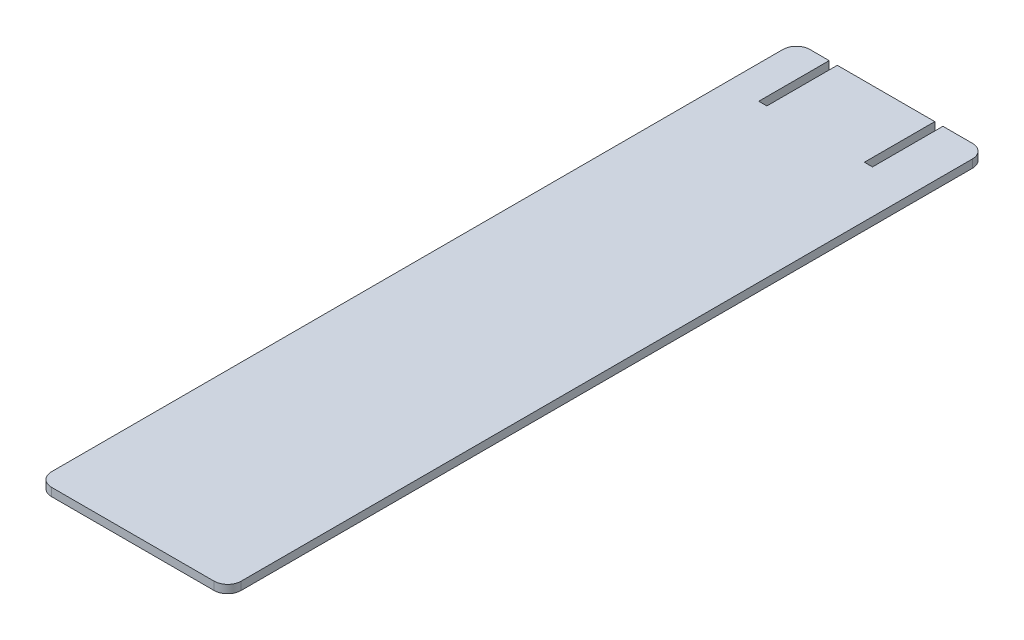
ISO-10303-21;
HEADER;
FILE_DESCRIPTION(('STEP AP214'),'2;1');
FILE_NAME('part.step','',(''),(''),'','','');
FILE_SCHEMA(('AUTOMOTIVE_DESIGN { 1 0 10303 214 1 1 1 1 }'));
ENDSEC;
DATA;
#1=APPLICATION_CONTEXT('core data for automotive mechanical design processes');
#2=APPLICATION_PROTOCOL_DEFINITION('international standard','automotive_design',2000,#1);
#3=PRODUCT_CONTEXT('',#1,'mechanical');
#4=PRODUCT('Part','Part','',(#3));
#5=PRODUCT_RELATED_PRODUCT_CATEGORY('part','',(#4));
#6=PRODUCT_DEFINITION_FORMATION('','',#4);
#7=PRODUCT_DEFINITION_CONTEXT('part definition',#1,'design');
#8=PRODUCT_DEFINITION('design','',#6,#7);
#9=PRODUCT_DEFINITION_SHAPE('','',#8);
#10=(LENGTH_UNIT() NAMED_UNIT(*) SI_UNIT(.MILLI.,.METRE.));
#11=(NAMED_UNIT(*) PLANE_ANGLE_UNIT() SI_UNIT($,.RADIAN.));
#12=(NAMED_UNIT(*) SI_UNIT($,.STERADIAN.) SOLID_ANGLE_UNIT());
#13=UNCERTAINTY_MEASURE_WITH_UNIT(LENGTH_MEASURE(1.E-05),#10,'distance_accuracy_value','');
#14=(GEOMETRIC_REPRESENTATION_CONTEXT(3) GLOBAL_UNCERTAINTY_ASSIGNED_CONTEXT((#13)) GLOBAL_UNIT_ASSIGNED_CONTEXT((#10,
#11,#12)) REPRESENTATION_CONTEXT('',''));
#15=CARTESIAN_POINT('',(0.,0.,0.));
#16=DIRECTION('',(0.,0.,1.));
#17=DIRECTION('',(1.,0.,0.));
#18=AXIS2_PLACEMENT_3D('',#15,#16,#17);
#19=CARTESIAN_POINT('',(145.580701970443,3.,-100.48875));
#20=DIRECTION('',(0.,0.,1.));
#21=DIRECTION('',(1.,0.,0.));
#22=AXIS2_PLACEMENT_3D('',#19,#20,#21);
#23=PLANE('',#22);
#24=DIRECTION('',(-1.,0.,0.));
#25=VECTOR('',#24,1.);
#26=CARTESIAN_POINT('',(145.580701970443,3.,-100.48875));
#27=LINE('',#26,#25);
#28=CARTESIAN_POINT('',(152.688003651187,3.,-100.48875));
#29=VERTEX_POINT('',#28);
#30=CARTESIAN_POINT('',(145.580701970443,3.,-100.48875));
#31=VERTEX_POINT('',#30);
#32=EDGE_CURVE('E213',#29,#31,#27,.T.);
#33=ORIENTED_EDGE('',*,*,#32,.F.);
#34=DIRECTION('',(0.,1.,0.));
#35=VECTOR('',#34,1.);
#36=CARTESIAN_POINT('',(152.688003651187,0.,-100.48875));
#37=LINE('',#36,#35);
#38=CARTESIAN_POINT('',(152.688003651187,0.,-100.48875));
#39=VERTEX_POINT('',#38);
#40=EDGE_CURVE('E175',#39,#29,#37,.T.);
#41=ORIENTED_EDGE('',*,*,#40,.F.);
#42=DIRECTION('',(-1.,0.,0.));
#43=VECTOR('',#42,1.);
#44=CARTESIAN_POINT('',(145.580701970443,0.,-100.48875));
#45=LINE('',#44,#43);
#46=CARTESIAN_POINT('',(145.580701970443,0.,-100.48875));
#47=VERTEX_POINT('',#46);
#48=EDGE_CURVE('E165',#39,#47,#45,.T.);
#49=ORIENTED_EDGE('',*,*,#48,.T.);
#50=DIRECTION('',(0.,-1.,0.));
#51=VECTOR('',#50,1.);
#52=CARTESIAN_POINT('',(145.580701970443,3.,-100.48875));
#53=LINE('',#52,#51);
#54=EDGE_CURVE('E255',#31,#47,#53,.T.);
#55=ORIENTED_EDGE('',*,*,#54,.F.);
#56=EDGE_LOOP('',(#33,#41,#49,#55));
#57=FACE_BOUND('',#56,.T.);
#58=ADVANCED_FACE('F32',(#57),#23,.F.);
#59=CARTESIAN_POINT('',(205.580701970443,0.,-100.48875));
#60=VERTEX_POINT('',#59);
#61=CARTESIAN_POINT('',(194.688003651187,0.,-100.48875));
#62=VERTEX_POINT('',#61);
#63=EDGE_CURVE('E233',#60,#62,#45,.T.);
#64=ORIENTED_EDGE('',*,*,#63,.T.);
#65=DIRECTION('',(0.,1.,0.));
#66=VECTOR('',#65,1.);
#67=CARTESIAN_POINT('',(194.688003651187,0.,-100.48875));
#68=LINE('',#67,#66);
#69=CARTESIAN_POINT('',(194.688003651187,3.,-100.48875));
#70=VERTEX_POINT('',#69);
#71=EDGE_CURVE('E190',#62,#70,#68,.T.);
#72=ORIENTED_EDGE('',*,*,#71,.T.);
#73=CARTESIAN_POINT('',(205.580701970443,3.,-100.48875));
#74=VERTEX_POINT('',#73);
#75=EDGE_CURVE('E214',#74,#70,#27,.T.);
#76=ORIENTED_EDGE('',*,*,#75,.F.);
#77=DIRECTION('',(0.,-1.,0.));
#78=VECTOR('',#77,1.);
#79=CARTESIAN_POINT('',(205.580701970443,3.,-100.48875));
#80=LINE('',#79,#78);
#81=EDGE_CURVE('E258',#74,#60,#80,.T.);
#82=ORIENTED_EDGE('',*,*,#81,.T.);
#83=EDGE_LOOP('',(#64,#72,#76,#82));
#84=FACE_BOUND('',#83,.T.);
#85=ADVANCED_FACE('F272',(#84),#23,.F.);
#86=CARTESIAN_POINT('',(205.580701970443,3.,174.51125));
#87=DIRECTION('',(0.,-1.,0.));
#88=DIRECTION('',(0.,0.,-1.));
#89=AXIS2_PLACEMENT_3D('',#86,#87,#88);
#90=CYLINDRICAL_SURFACE('',#89,5.);
#91=CARTESIAN_POINT('',(205.580701970443,0.,174.51125));
#92=DIRECTION('',(0.,1.,0.));
#93=DIRECTION('',(0.,0.,1.));
#94=AXIS2_PLACEMENT_3D('',#91,#92,#93);
#95=CIRCLE('',#94,5.);
#96=CARTESIAN_POINT('',(205.580701970443,0.,179.51125));
#97=VERTEX_POINT('',#96);
#98=CARTESIAN_POINT('',(210.580701970443,0.,174.51125));
#99=VERTEX_POINT('',#98);
#100=EDGE_CURVE('E177',#97,#99,#95,.T.);
#101=ORIENTED_EDGE('',*,*,#100,.T.);
#102=DIRECTION('',(0.,-1.,0.));
#103=VECTOR('',#102,1.);
#104=CARTESIAN_POINT('',(210.580701970443,3.,174.51125));
#105=LINE('',#104,#103);
#106=CARTESIAN_POINT('',(210.580701970443,3.,174.51125));
#107=VERTEX_POINT('',#106);
#108=EDGE_CURVE('E11',#107,#99,#105,.T.);
#109=ORIENTED_EDGE('',*,*,#108,.F.);
#110=CARTESIAN_POINT('',(205.580701970443,3.,174.51125));
#111=DIRECTION('',(0.,1.,0.));
#112=DIRECTION('',(0.,0.,1.));
#113=AXIS2_PLACEMENT_3D('',#110,#111,#112);
#114=CIRCLE('',#113,5.);
#115=CARTESIAN_POINT('',(205.580701970443,3.,179.51125));
#116=VERTEX_POINT('',#115);
#117=EDGE_CURVE('E205',#116,#107,#114,.T.);
#118=ORIENTED_EDGE('',*,*,#117,.F.);
#119=DIRECTION('',(0.,-1.,0.));
#120=VECTOR('',#119,1.);
#121=CARTESIAN_POINT('',(205.580701970443,3.,179.51125));
#122=LINE('',#121,#120);
#123=EDGE_CURVE('E226',#116,#97,#122,.T.);
#124=ORIENTED_EDGE('',*,*,#123,.T.);
#125=EDGE_LOOP('',(#101,#109,#118,#124));
#126=FACE_BOUND('',#125,.T.);
#127=ADVANCED_FACE('F34',(#126),#90,.T.);
#128=CARTESIAN_POINT('',(210.580701970443,3.,-95.48875));
#129=DIRECTION('',(-1.,0.,0.));
#130=DIRECTION('',(0.,0.,1.));
#131=AXIS2_PLACEMENT_3D('',#128,#129,#130);
#132=PLANE('',#131);
#133=DIRECTION('',(0.,0.,-1.));
#134=VECTOR('',#133,1.);
#135=CARTESIAN_POINT('',(210.580701970443,0.,-95.48875));
#136=LINE('',#135,#134);
#137=CARTESIAN_POINT('',(210.580701970443,0.,-95.48875));
#138=VERTEX_POINT('',#137);
#139=EDGE_CURVE('E229',#99,#138,#136,.T.);
#140=ORIENTED_EDGE('',*,*,#139,.T.);
#141=DIRECTION('',(0.,-1.,0.));
#142=VECTOR('',#141,1.);
#143=CARTESIAN_POINT('',(210.580701970443,3.,-95.48875));
#144=LINE('',#143,#142);
#145=CARTESIAN_POINT('',(210.580701970443,3.,-95.48875));
#146=VERTEX_POINT('',#145);
#147=EDGE_CURVE('E40',#146,#138,#144,.T.);
#148=ORIENTED_EDGE('',*,*,#147,.F.);
#149=DIRECTION('',(0.,0.,-1.));
#150=VECTOR('',#149,1.);
#151=CARTESIAN_POINT('',(210.580701970443,3.,-95.48875));
#152=LINE('',#151,#150);
#153=EDGE_CURVE('E208',#107,#146,#152,.T.);
#154=ORIENTED_EDGE('',*,*,#153,.F.);
#155=ORIENTED_EDGE('',*,*,#108,.T.);
#156=EDGE_LOOP('',(#140,#148,#154,#155));
#157=FACE_BOUND('',#156,.T.);
#158=ADVANCED_FACE('F280',(#157),#132,.F.);
#159=CARTESIAN_POINT('',(205.580701970443,3.,-95.48875));
#160=DIRECTION('',(0.,-1.,0.));
#161=DIRECTION('',(0.,0.,-1.));
#162=AXIS2_PLACEMENT_3D('',#159,#160,#161);
#163=CYLINDRICAL_SURFACE('',#162,5.);
#164=CARTESIAN_POINT('',(205.580701970443,0.,-95.48875));
#165=DIRECTION('',(0.,1.,0.));
#166=DIRECTION('',(0.,0.,-1.));
#167=AXIS2_PLACEMENT_3D('',#164,#165,#166);
#168=CIRCLE('',#167,5.);
#169=EDGE_CURVE('E231',#138,#60,#168,.T.);
#170=ORIENTED_EDGE('',*,*,#169,.T.);
#171=ORIENTED_EDGE('',*,*,#81,.F.);
#172=CARTESIAN_POINT('',(205.580701970443,3.,-95.48875));
#173=DIRECTION('',(0.,1.,0.));
#174=DIRECTION('',(0.,0.,-1.));
#175=AXIS2_PLACEMENT_3D('',#172,#173,#174);
#176=CIRCLE('',#175,5.);
#177=EDGE_CURVE('E211',#146,#74,#176,.T.);
#178=ORIENTED_EDGE('',*,*,#177,.F.);
#179=ORIENTED_EDGE('',*,*,#147,.T.);
#180=EDGE_LOOP('',(#170,#171,#178,#179));
#181=FACE_BOUND('',#180,.T.);
#182=ADVANCED_FACE('F265',(#181),#163,.T.);
#183=CARTESIAN_POINT('',(191.688003651187,0.,-100.48875));
#184=VERTEX_POINT('',#183);
#185=CARTESIAN_POINT('',(155.688003651187,0.,-100.48875));
#186=VERTEX_POINT('',#185);
#187=EDGE_CURVE('E237',#184,#186,#45,.T.);
#188=ORIENTED_EDGE('',*,*,#187,.T.);
#189=DIRECTION('',(0.,1.,0.));
#190=VECTOR('',#189,1.);
#191=CARTESIAN_POINT('',(155.688003651187,0.,-100.48875));
#192=LINE('',#191,#190);
#193=CARTESIAN_POINT('',(155.688003651187,3.,-100.48875));
#194=VERTEX_POINT('',#193);
#195=EDGE_CURVE('E178',#186,#194,#192,.T.);
#196=ORIENTED_EDGE('',*,*,#195,.T.);
#197=CARTESIAN_POINT('',(191.688003651187,3.,-100.48875));
#198=VERTEX_POINT('',#197);
#199=EDGE_CURVE('E218',#198,#194,#27,.T.);
#200=ORIENTED_EDGE('',*,*,#199,.F.);
#201=DIRECTION('',(0.,1.,0.));
#202=VECTOR('',#201,1.);
#203=CARTESIAN_POINT('',(191.688003651187,0.,-100.48875));
#204=LINE('',#203,#202);
#205=EDGE_CURVE('E201',#184,#198,#204,.T.);
#206=ORIENTED_EDGE('',*,*,#205,.F.);
#207=EDGE_LOOP('',(#188,#196,#200,#206));
#208=FACE_BOUND('',#207,.T.);
#209=ADVANCED_FACE('F308',(#208),#23,.F.);
#210=CARTESIAN_POINT('',(145.580701970443,3.,-95.48875));
#211=DIRECTION('',(0.,-1.,0.));
#212=DIRECTION('',(0.,0.,-1.));
#213=AXIS2_PLACEMENT_3D('',#210,#211,#212);
#214=CYLINDRICAL_SURFACE('',#213,5.);
#215=CARTESIAN_POINT('',(145.580701970443,0.,-95.48875));
#216=DIRECTION('',(0.,1.,0.));
#217=DIRECTION('',(0.,0.,1.));
#218=AXIS2_PLACEMENT_3D('',#215,#216,#217);
#219=CIRCLE('',#218,5.);
#220=CARTESIAN_POINT('',(140.580701970443,0.,-95.48875));
#221=VERTEX_POINT('',#220);
#222=EDGE_CURVE('E236',#47,#221,#219,.T.);
#223=ORIENTED_EDGE('',*,*,#222,.T.);
#224=DIRECTION('',(0.,-1.,0.));
#225=VECTOR('',#224,1.);
#226=CARTESIAN_POINT('',(140.580701970443,3.,-95.48875));
#227=LINE('',#226,#225);
#228=CARTESIAN_POINT('',(140.580701970443,3.,-95.48875));
#229=VERTEX_POINT('',#228);
#230=EDGE_CURVE('E252',#229,#221,#227,.T.);
#231=ORIENTED_EDGE('',*,*,#230,.F.);
#232=CARTESIAN_POINT('',(145.580701970443,3.,-95.48875));
#233=DIRECTION('',(0.,1.,0.));
#234=DIRECTION('',(0.,0.,1.));
#235=AXIS2_PLACEMENT_3D('',#232,#233,#234);
#236=CIRCLE('',#235,5.);
#237=EDGE_CURVE('E217',#31,#229,#236,.T.);
#238=ORIENTED_EDGE('',*,*,#237,.F.);
#239=ORIENTED_EDGE('',*,*,#54,.T.);
#240=EDGE_LOOP('',(#223,#231,#238,#239));
#241=FACE_BOUND('',#240,.T.);
#242=ADVANCED_FACE('F299',(#241),#214,.T.);
#243=CARTESIAN_POINT('',(140.580701970443,3.,-95.48875));
#244=DIRECTION('',(1.,0.,0.));
#245=DIRECTION('',(0.,0.,-1.));
#246=AXIS2_PLACEMENT_3D('',#243,#244,#245);
#247=PLANE('',#246);
#248=DIRECTION('',(0.,0.,1.));
#249=VECTOR('',#248,1.);
#250=CARTESIAN_POINT('',(140.580701970443,0.,-95.48875));
#251=LINE('',#250,#249);
#252=CARTESIAN_POINT('',(140.580701970443,0.,174.51125));
#253=VERTEX_POINT('',#252);
#254=EDGE_CURVE('E239',#221,#253,#251,.T.);
#255=ORIENTED_EDGE('',*,*,#254,.T.);
#256=DIRECTION('',(0.,-1.,0.));
#257=VECTOR('',#256,1.);
#258=CARTESIAN_POINT('',(140.580701970443,3.,174.51125));
#259=LINE('',#258,#257);
#260=CARTESIAN_POINT('',(140.580701970443,3.,174.51125));
#261=VERTEX_POINT('',#260);
#262=EDGE_CURVE('E249',#261,#253,#259,.T.);
#263=ORIENTED_EDGE('',*,*,#262,.F.);
#264=DIRECTION('',(0.,0.,1.));
#265=VECTOR('',#264,1.);
#266=CARTESIAN_POINT('',(140.580701970443,3.,-95.48875));
#267=LINE('',#266,#265);
#268=EDGE_CURVE('E220',#229,#261,#267,.T.);
#269=ORIENTED_EDGE('',*,*,#268,.F.);
#270=ORIENTED_EDGE('',*,*,#230,.T.);
#271=EDGE_LOOP('',(#255,#263,#269,#270));
#272=FACE_BOUND('',#271,.T.);
#273=ADVANCED_FACE('F296',(#272),#247,.F.);
#274=CARTESIAN_POINT('',(145.580701970443,3.,174.51125));
#275=DIRECTION('',(0.,-1.,0.));
#276=DIRECTION('',(0.,0.,-1.));
#277=AXIS2_PLACEMENT_3D('',#274,#275,#276);
#278=CYLINDRICAL_SURFACE('',#277,5.);
#279=CARTESIAN_POINT('',(145.580701970443,0.,174.51125));
#280=DIRECTION('',(0.,1.,0.));
#281=DIRECTION('',(0.,0.,1.));
#282=AXIS2_PLACEMENT_3D('',#279,#280,#281);
#283=CIRCLE('',#282,5.);
#284=CARTESIAN_POINT('',(145.580701970443,0.,179.51125));
#285=VERTEX_POINT('',#284);
#286=EDGE_CURVE('E241',#253,#285,#283,.T.);
#287=ORIENTED_EDGE('',*,*,#286,.T.);
#288=DIRECTION('',(0.,-1.,0.));
#289=VECTOR('',#288,1.);
#290=CARTESIAN_POINT('',(145.580701970443,3.,179.51125));
#291=LINE('',#290,#289);
#292=CARTESIAN_POINT('',(145.580701970443,3.,179.51125));
#293=VERTEX_POINT('',#292);
#294=EDGE_CURVE('E246',#293,#285,#291,.T.);
#295=ORIENTED_EDGE('',*,*,#294,.F.);
#296=CARTESIAN_POINT('',(145.580701970443,3.,174.51125));
#297=DIRECTION('',(0.,1.,0.));
#298=DIRECTION('',(0.,0.,1.));
#299=AXIS2_PLACEMENT_3D('',#296,#297,#298);
#300=CIRCLE('',#299,5.);
#301=EDGE_CURVE('E222',#261,#293,#300,.T.);
#302=ORIENTED_EDGE('',*,*,#301,.F.);
#303=ORIENTED_EDGE('',*,*,#262,.T.);
#304=EDGE_LOOP('',(#287,#295,#302,#303));
#305=FACE_BOUND('',#304,.T.);
#306=ADVANCED_FACE('F292',(#305),#278,.T.);
#307=CARTESIAN_POINT('',(145.580701970443,3.,179.51125));
#308=DIRECTION('',(0.,0.,-1.));
#309=DIRECTION('',(-1.,0.,0.));
#310=AXIS2_PLACEMENT_3D('',#307,#308,#309);
#311=PLANE('',#310);
#312=DIRECTION('',(1.,0.,0.));
#313=VECTOR('',#312,1.);
#314=CARTESIAN_POINT('',(145.580701970443,0.,179.51125));
#315=LINE('',#314,#313);
#316=EDGE_CURVE('E209',#285,#97,#315,.T.);
#317=ORIENTED_EDGE('',*,*,#316,.T.);
#318=ORIENTED_EDGE('',*,*,#123,.F.);
#319=DIRECTION('',(1.,0.,0.));
#320=VECTOR('',#319,1.);
#321=CARTESIAN_POINT('',(145.580701970443,3.,179.51125));
#322=LINE('',#321,#320);
#323=EDGE_CURVE('E224',#293,#116,#322,.T.);
#324=ORIENTED_EDGE('',*,*,#323,.F.);
#325=ORIENTED_EDGE('',*,*,#294,.T.);
#326=EDGE_LOOP('',(#317,#318,#324,#325));
#327=FACE_BOUND('',#326,.T.);
#328=ADVANCED_FACE('F287',(#327),#311,.F.);
#329=CARTESIAN_POINT('',(205.580701970443,3.,174.51125));
#330=DIRECTION('',(0.,1.,0.));
#331=DIRECTION('',(0.,0.,1.));
#332=AXIS2_PLACEMENT_3D('',#329,#330,#331);
#333=PLANE('',#332);
#334=DIRECTION('',(0.,0.,1.));
#335=VECTOR('',#334,1.);
#336=CARTESIAN_POINT('',(152.688003651187,3.,-74.48875));
#337=LINE('',#336,#335);
#338=CARTESIAN_POINT('',(152.688003651187,3.,-74.48875));
#339=VERTEX_POINT('',#338);
#340=EDGE_CURVE('E151',#29,#339,#337,.T.);
#341=ORIENTED_EDGE('',*,*,#340,.F.);
#342=ORIENTED_EDGE('',*,*,#32,.T.);
#343=ORIENTED_EDGE('',*,*,#237,.T.);
#344=ORIENTED_EDGE('',*,*,#268,.T.);
#345=ORIENTED_EDGE('',*,*,#301,.T.);
#346=ORIENTED_EDGE('',*,*,#323,.T.);
#347=ORIENTED_EDGE('',*,*,#117,.T.);
#348=ORIENTED_EDGE('',*,*,#153,.T.);
#349=ORIENTED_EDGE('',*,*,#177,.T.);
#350=ORIENTED_EDGE('',*,*,#75,.T.);
#351=DIRECTION('',(0.,0.,-1.));
#352=VECTOR('',#351,1.);
#353=CARTESIAN_POINT('',(194.688003651187,3.,-100.48875));
#354=LINE('',#353,#352);
#355=CARTESIAN_POINT('',(194.688003651187,3.,-74.48875));
#356=VERTEX_POINT('',#355);
#357=EDGE_CURVE('E191',#356,#70,#354,.T.);
#358=ORIENTED_EDGE('',*,*,#357,.F.);
#359=DIRECTION('',(1.,0.,0.));
#360=VECTOR('',#359,1.);
#361=CARTESIAN_POINT('',(194.688003651187,3.,-74.48875));
#362=LINE('',#361,#360);
#363=CARTESIAN_POINT('',(191.688003651187,3.,-74.48875));
#364=VERTEX_POINT('',#363);
#365=EDGE_CURVE('E186',#364,#356,#362,.T.);
#366=ORIENTED_EDGE('',*,*,#365,.F.);
#367=DIRECTION('',(0.,0.,1.));
#368=VECTOR('',#367,1.);
#369=CARTESIAN_POINT('',(191.688003651187,3.,-74.48875));
#370=LINE('',#369,#368);
#371=EDGE_CURVE('E193',#198,#364,#370,.T.);
#372=ORIENTED_EDGE('',*,*,#371,.F.);
#373=ORIENTED_EDGE('',*,*,#199,.T.);
#374=DIRECTION('',(0.,0.,-1.));
#375=VECTOR('',#374,1.);
#376=CARTESIAN_POINT('',(155.688003651187,3.,-100.48875));
#377=LINE('',#376,#375);
#378=CARTESIAN_POINT('',(155.688003651187,3.,-74.48875));
#379=VERTEX_POINT('',#378);
#380=EDGE_CURVE('E166',#379,#194,#377,.T.);
#381=ORIENTED_EDGE('',*,*,#380,.F.);
#382=DIRECTION('',(1.,0.,0.));
#383=VECTOR('',#382,1.);
#384=CARTESIAN_POINT('',(155.688003651187,3.,-74.48875));
#385=LINE('',#384,#383);
#386=EDGE_CURVE('E168',#339,#379,#385,.T.);
#387=ORIENTED_EDGE('',*,*,#386,.F.);
#388=EDGE_LOOP('',(#341,#342,#343,#344,#345,#346,#347,#348,#349,#350,#358,#366,#372,#373,#381,#387));
#389=FACE_BOUND('',#388,.T.);
#390=ADVANCED_FACE('F276',(#389),#333,.T.);
#391=CARTESIAN_POINT('',(205.580701970443,0.,174.51125));
#392=DIRECTION('',(0.,1.,0.));
#393=DIRECTION('',(0.,0.,1.));
#394=AXIS2_PLACEMENT_3D('',#391,#392,#393);
#395=PLANE('',#394);
#396=ORIENTED_EDGE('',*,*,#48,.F.);
#397=DIRECTION('',(0.,0.,1.));
#398=VECTOR('',#397,1.);
#399=CARTESIAN_POINT('',(152.688003651187,0.,-74.48875));
#400=LINE('',#399,#398);
#401=CARTESIAN_POINT('',(152.688003651187,0.,-74.48875));
#402=VERTEX_POINT('',#401);
#403=EDGE_CURVE('E148',#39,#402,#400,.T.);
#404=ORIENTED_EDGE('',*,*,#403,.T.);
#405=DIRECTION('',(1.,0.,0.));
#406=VECTOR('',#405,1.);
#407=CARTESIAN_POINT('',(155.688003651187,0.,-74.48875));
#408=LINE('',#407,#406);
#409=CARTESIAN_POINT('',(155.688003651187,0.,-74.48875));
#410=VERTEX_POINT('',#409);
#411=EDGE_CURVE('E158',#402,#410,#408,.T.);
#412=ORIENTED_EDGE('',*,*,#411,.T.);
#413=DIRECTION('',(0.,0.,-1.));
#414=VECTOR('',#413,1.);
#415=CARTESIAN_POINT('',(155.688003651187,0.,-100.48875));
#416=LINE('',#415,#414);
#417=EDGE_CURVE('E47',#410,#186,#416,.T.);
#418=ORIENTED_EDGE('',*,*,#417,.T.);
#419=ORIENTED_EDGE('',*,*,#187,.F.);
#420=DIRECTION('',(0.,0.,1.));
#421=VECTOR('',#420,1.);
#422=CARTESIAN_POINT('',(191.688003651187,0.,-74.48875));
#423=LINE('',#422,#421);
#424=CARTESIAN_POINT('',(191.688003651187,0.,-74.48875));
#425=VERTEX_POINT('',#424);
#426=EDGE_CURVE('E185',#184,#425,#423,.T.);
#427=ORIENTED_EDGE('',*,*,#426,.T.);
#428=DIRECTION('',(1.,0.,0.));
#429=VECTOR('',#428,1.);
#430=CARTESIAN_POINT('',(194.688003651187,0.,-74.48875));
#431=LINE('',#430,#429);
#432=CARTESIAN_POINT('',(194.688003651187,0.,-74.48875));
#433=VERTEX_POINT('',#432);
#434=EDGE_CURVE('E55',#425,#433,#431,.T.);
#435=ORIENTED_EDGE('',*,*,#434,.T.);
#436=DIRECTION('',(0.,0.,-1.));
#437=VECTOR('',#436,1.);
#438=CARTESIAN_POINT('',(194.688003651187,0.,-100.48875));
#439=LINE('',#438,#437);
#440=EDGE_CURVE('E182',#433,#62,#439,.T.);
#441=ORIENTED_EDGE('',*,*,#440,.T.);
#442=ORIENTED_EDGE('',*,*,#63,.F.);
#443=ORIENTED_EDGE('',*,*,#169,.F.);
#444=ORIENTED_EDGE('',*,*,#139,.F.);
#445=ORIENTED_EDGE('',*,*,#100,.F.);
#446=ORIENTED_EDGE('',*,*,#316,.F.);
#447=ORIENTED_EDGE('',*,*,#286,.F.);
#448=ORIENTED_EDGE('',*,*,#254,.F.);
#449=ORIENTED_EDGE('',*,*,#222,.F.);
#450=EDGE_LOOP('',(#396,#404,#412,#418,#419,#427,#435,#441,#442,#443,#444,#445,#446,#447,#448,#449));
#451=FACE_BOUND('',#450,.T.);
#452=ADVANCED_FACE('F163',(#451),#395,.F.);
#453=CARTESIAN_POINT('',(194.688003651187,0.,-100.48875));
#454=DIRECTION('',(1.,0.,0.));
#455=DIRECTION('',(0.,0.,-1.));
#456=AXIS2_PLACEMENT_3D('',#453,#454,#455);
#457=PLANE('',#456);
#458=ORIENTED_EDGE('',*,*,#357,.T.);
#459=ORIENTED_EDGE('',*,*,#71,.F.);
#460=ORIENTED_EDGE('',*,*,#440,.F.);
#461=DIRECTION('',(0.,1.,0.));
#462=VECTOR('',#461,1.);
#463=CARTESIAN_POINT('',(194.688003651187,0.,-74.48875));
#464=LINE('',#463,#462);
#465=EDGE_CURVE('E173',#433,#356,#464,.T.);
#466=ORIENTED_EDGE('',*,*,#465,.T.);
#467=EDGE_LOOP('',(#458,#459,#460,#466));
#468=FACE_BOUND('',#467,.T.);
#469=ADVANCED_FACE('F377',(#468),#457,.F.);
#470=CARTESIAN_POINT('',(194.688003651187,0.,-74.48875));
#471=DIRECTION('',(0.,0.,1.));
#472=DIRECTION('',(1.,0.,0.));
#473=AXIS2_PLACEMENT_3D('',#470,#471,#472);
#474=PLANE('',#473);
#475=ORIENTED_EDGE('',*,*,#365,.T.);
#476=ORIENTED_EDGE('',*,*,#465,.F.);
#477=ORIENTED_EDGE('',*,*,#434,.F.);
#478=DIRECTION('',(0.,1.,0.));
#479=VECTOR('',#478,1.);
#480=CARTESIAN_POINT('',(191.688003651187,0.,-74.48875));
#481=LINE('',#480,#479);
#482=EDGE_CURVE('E199',#425,#364,#481,.T.);
#483=ORIENTED_EDGE('',*,*,#482,.T.);
#484=EDGE_LOOP('',(#475,#476,#477,#483));
#485=FACE_BOUND('',#484,.T.);
#486=ADVANCED_FACE('F314',(#485),#474,.F.);
#487=CARTESIAN_POINT('',(191.688003651187,0.,-74.48875));
#488=DIRECTION('',(-1.,0.,0.));
#489=DIRECTION('',(0.,0.,1.));
#490=AXIS2_PLACEMENT_3D('',#487,#488,#489);
#491=PLANE('',#490);
#492=ORIENTED_EDGE('',*,*,#371,.T.);
#493=ORIENTED_EDGE('',*,*,#482,.F.);
#494=ORIENTED_EDGE('',*,*,#426,.F.);
#495=ORIENTED_EDGE('',*,*,#205,.T.);
#496=EDGE_LOOP('',(#492,#493,#494,#495));
#497=FACE_BOUND('',#496,.T.);
#498=ADVANCED_FACE('F312',(#497),#491,.F.);
#499=CARTESIAN_POINT('',(152.688003651187,0.,-74.48875));
#500=DIRECTION('',(-1.,0.,0.));
#501=DIRECTION('',(0.,0.,1.));
#502=AXIS2_PLACEMENT_3D('',#499,#500,#501);
#503=PLANE('',#502);
#504=ORIENTED_EDGE('',*,*,#340,.T.);
#505=DIRECTION('',(0.,1.,0.));
#506=VECTOR('',#505,1.);
#507=CARTESIAN_POINT('',(152.688003651187,0.,-74.48875));
#508=LINE('',#507,#506);
#509=EDGE_CURVE('E144',#402,#339,#508,.T.);
#510=ORIENTED_EDGE('',*,*,#509,.F.);
#511=ORIENTED_EDGE('',*,*,#403,.F.);
#512=ORIENTED_EDGE('',*,*,#40,.T.);
#513=EDGE_LOOP('',(#504,#510,#511,#512));
#514=FACE_BOUND('',#513,.T.);
#515=ADVANCED_FACE('F146',(#514),#503,.F.);
#516=CARTESIAN_POINT('',(155.688003651187,0.,-100.48875));
#517=DIRECTION('',(1.,0.,0.));
#518=DIRECTION('',(0.,0.,-1.));
#519=AXIS2_PLACEMENT_3D('',#516,#517,#518);
#520=PLANE('',#519);
#521=ORIENTED_EDGE('',*,*,#380,.T.);
#522=ORIENTED_EDGE('',*,*,#195,.F.);
#523=ORIENTED_EDGE('',*,*,#417,.F.);
#524=DIRECTION('',(0.,1.,0.));
#525=VECTOR('',#524,1.);
#526=CARTESIAN_POINT('',(155.688003651187,0.,-74.48875));
#527=LINE('',#526,#525);
#528=EDGE_CURVE('E155',#410,#379,#527,.T.);
#529=ORIENTED_EDGE('',*,*,#528,.T.);
#530=EDGE_LOOP('',(#521,#522,#523,#529));
#531=FACE_BOUND('',#530,.T.);
#532=ADVANCED_FACE('F316',(#531),#520,.F.);
#533=CARTESIAN_POINT('',(155.688003651187,0.,-74.48875));
#534=DIRECTION('',(0.,0.,1.));
#535=DIRECTION('',(1.,0.,0.));
#536=AXIS2_PLACEMENT_3D('',#533,#534,#535);
#537=PLANE('',#536);
#538=ORIENTED_EDGE('',*,*,#386,.T.);
#539=ORIENTED_EDGE('',*,*,#528,.F.);
#540=ORIENTED_EDGE('',*,*,#411,.F.);
#541=ORIENTED_EDGE('',*,*,#509,.T.);
#542=EDGE_LOOP('',(#538,#539,#540,#541));
#543=FACE_BOUND('',#542,.T.);
#544=ADVANCED_FACE('F159',(#543),#537,.F.);
#545=CLOSED_SHELL('',(#58,#85,#127,#158,#182,#209,#242,#273,#306,#328,#390,#452,#469,#486,#498,
#515,#532,#544));
#546=MANIFOLD_SOLID_BREP('B2',#545);
#547=ADVANCED_BREP_SHAPE_REPRESENTATION('',(#18,#546),#14);
#548=SHAPE_DEFINITION_REPRESENTATION(#9,#547);
ENDSEC;
END-ISO-10303-21;
